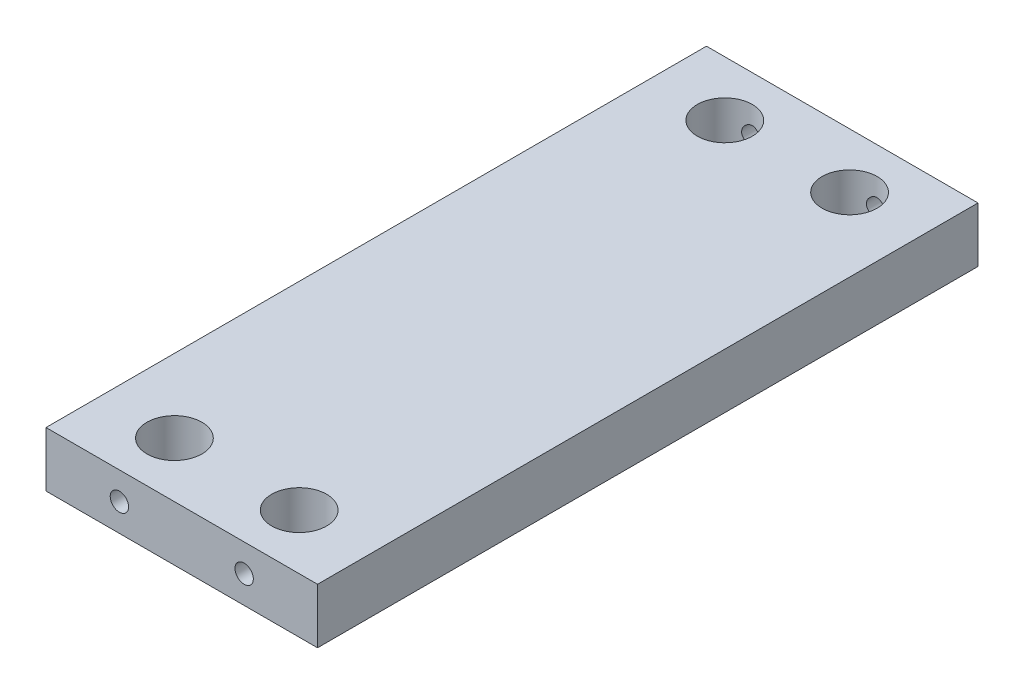
ISO-10303-21;
HEADER;
FILE_DESCRIPTION(('STEP AP214'),'2;1');
FILE_NAME('part.step','',(''),(''),'','','');
FILE_SCHEMA(('AUTOMOTIVE_DESIGN { 1 0 10303 214 1 1 1 1 }'));
ENDSEC;
DATA;
#1=APPLICATION_CONTEXT('core data for automotive mechanical design processes');
#2=APPLICATION_PROTOCOL_DEFINITION('international standard','automotive_design',2000,#1);
#3=PRODUCT_CONTEXT('',#1,'mechanical');
#4=PRODUCT('Part','Part','',(#3));
#5=PRODUCT_RELATED_PRODUCT_CATEGORY('part','',(#4));
#6=PRODUCT_DEFINITION_FORMATION('','',#4);
#7=PRODUCT_DEFINITION_CONTEXT('part definition',#1,'design');
#8=PRODUCT_DEFINITION('design','',#6,#7);
#9=PRODUCT_DEFINITION_SHAPE('','',#8);
#10=(LENGTH_UNIT() NAMED_UNIT(*) SI_UNIT(.MILLI.,.METRE.));
#11=(NAMED_UNIT(*) PLANE_ANGLE_UNIT() SI_UNIT($,.RADIAN.));
#12=(NAMED_UNIT(*) SI_UNIT($,.STERADIAN.) SOLID_ANGLE_UNIT());
#13=UNCERTAINTY_MEASURE_WITH_UNIT(LENGTH_MEASURE(1.E-05),#10,'distance_accuracy_value','');
#14=(GEOMETRIC_REPRESENTATION_CONTEXT(3) GLOBAL_UNCERTAINTY_ASSIGNED_CONTEXT((#13)) GLOBAL_UNIT_ASSIGNED_CONTEXT((#10,
#11,#12)) REPRESENTATION_CONTEXT('',''));
#15=CARTESIAN_POINT('',(0.,0.,0.));
#16=DIRECTION('',(0.,0.,1.));
#17=DIRECTION('',(1.,0.,0.));
#18=AXIS2_PLACEMENT_3D('',#15,#16,#17);
#19=CARTESIAN_POINT('',(46.99,19.05,-114.3));
#20=DIRECTION('',(-1.,0.,0.));
#21=DIRECTION('',(0.,0.,1.));
#22=AXIS2_PLACEMENT_3D('',#19,#20,#21);
#23=PLANE('',#22);
#24=DIRECTION('',(0.,0.,-1.));
#25=VECTOR('',#24,1.);
#26=CARTESIAN_POINT('',(46.99,0.,-114.3));
#27=LINE('',#26,#25);
#28=CARTESIAN_POINT('',(46.99,0.,114.3));
#29=VERTEX_POINT('',#28);
#30=CARTESIAN_POINT('',(46.99,0.,-114.3));
#31=VERTEX_POINT('',#30);
#32=EDGE_CURVE('E104',#29,#31,#27,.T.);
#33=ORIENTED_EDGE('',*,*,#32,.T.);
#34=DIRECTION('',(0.,-1.,0.));
#35=VECTOR('',#34,1.);
#36=CARTESIAN_POINT('',(46.99,19.05,-114.3));
#37=LINE('',#36,#35);
#38=CARTESIAN_POINT('',(46.99,19.05,-114.3));
#39=VERTEX_POINT('',#38);
#40=EDGE_CURVE('E11',#39,#31,#37,.T.);
#41=ORIENTED_EDGE('',*,*,#40,.F.);
#42=DIRECTION('',(0.,0.,-1.));
#43=VECTOR('',#42,1.);
#44=CARTESIAN_POINT('',(46.99,19.05,-114.3));
#45=LINE('',#44,#43);
#46=CARTESIAN_POINT('',(46.99,19.05,114.3));
#47=VERTEX_POINT('',#46);
#48=EDGE_CURVE('E91',#47,#39,#45,.T.);
#49=ORIENTED_EDGE('',*,*,#48,.F.);
#50=DIRECTION('',(0.,-1.,0.));
#51=VECTOR('',#50,1.);
#52=CARTESIAN_POINT('',(46.99,19.05,114.3));
#53=LINE('',#52,#51);
#54=EDGE_CURVE('E100',#47,#29,#53,.T.);
#55=ORIENTED_EDGE('',*,*,#54,.T.);
#56=EDGE_LOOP('',(#33,#41,#49,#55));
#57=FACE_BOUND('',#56,.T.);
#58=ADVANCED_FACE('F34',(#57),#23,.F.);
#59=CARTESIAN_POINT('',(-46.99,19.05,-114.3));
#60=DIRECTION('',(0.,0.,1.));
#61=DIRECTION('',(1.,0.,0.));
#62=AXIS2_PLACEMENT_3D('',#59,#60,#61);
#63=PLANE('',#62);
#64=CARTESIAN_POINT('',(-21.59,9.525,-114.3));
#65=DIRECTION('',(0.,0.,-1.));
#66=DIRECTION('',(-1.,0.,0.));
#67=AXIS2_PLACEMENT_3D('',#64,#65,#66);
#68=CIRCLE('',#67,3.175);
#69=CARTESIAN_POINT('',(-24.765,9.525,-114.3));
#70=VERTEX_POINT('',#69);
#71=EDGE_CURVE('E309',#70,#70,#68,.T.);
#72=ORIENTED_EDGE('',*,*,#71,.F.);
#73=EDGE_LOOP('',(#72));
#74=FACE_BOUND('',#73,.T.);
#75=CARTESIAN_POINT('',(21.59,9.525,-114.3));
#76=DIRECTION('',(0.,0.,-1.));
#77=DIRECTION('',(-1.,0.,0.));
#78=AXIS2_PLACEMENT_3D('',#75,#76,#77);
#79=CIRCLE('',#78,3.175);
#80=CARTESIAN_POINT('',(18.415,9.525,-114.3));
#81=VERTEX_POINT('',#80);
#82=EDGE_CURVE('E121',#81,#81,#79,.T.);
#83=ORIENTED_EDGE('',*,*,#82,.F.);
#84=EDGE_LOOP('',(#83));
#85=FACE_BOUND('',#84,.T.);
#86=DIRECTION('',(-1.,0.,0.));
#87=VECTOR('',#86,1.);
#88=CARTESIAN_POINT('',(-46.99,0.,-114.3));
#89=LINE('',#88,#87);
#90=CARTESIAN_POINT('',(-46.99,0.,-114.3));
#91=VERTEX_POINT('',#90);
#92=EDGE_CURVE('E95',#31,#91,#89,.T.);
#93=ORIENTED_EDGE('',*,*,#92,.T.);
#94=DIRECTION('',(0.,-1.,0.));
#95=VECTOR('',#94,1.);
#96=CARTESIAN_POINT('',(-46.99,19.05,-114.3));
#97=LINE('',#96,#95);
#98=CARTESIAN_POINT('',(-46.99,19.05,-114.3));
#99=VERTEX_POINT('',#98);
#100=EDGE_CURVE('E47',#99,#91,#97,.T.);
#101=ORIENTED_EDGE('',*,*,#100,.F.);
#102=DIRECTION('',(-1.,0.,0.));
#103=VECTOR('',#102,1.);
#104=CARTESIAN_POINT('',(-46.99,19.05,-114.3));
#105=LINE('',#104,#103);
#106=EDGE_CURVE('E86',#39,#99,#105,.T.);
#107=ORIENTED_EDGE('',*,*,#106,.F.);
#108=ORIENTED_EDGE('',*,*,#40,.T.);
#109=EDGE_LOOP('',(#93,#101,#107,#108));
#110=FACE_BOUND('',#109,.T.);
#111=ADVANCED_FACE('F94',(#74,#85,#110),#63,.F.);
#112=CARTESIAN_POINT('',(-46.99,19.05,-114.3));
#113=DIRECTION('',(1.,0.,0.));
#114=DIRECTION('',(0.,0.,-1.));
#115=AXIS2_PLACEMENT_3D('',#112,#113,#114);
#116=PLANE('',#115);
#117=DIRECTION('',(0.,0.,1.));
#118=VECTOR('',#117,1.);
#119=CARTESIAN_POINT('',(-46.99,0.,-114.3));
#120=LINE('',#119,#118);
#121=CARTESIAN_POINT('',(-46.99,0.,114.3));
#122=VERTEX_POINT('',#121);
#123=EDGE_CURVE('E73',#91,#122,#120,.T.);
#124=ORIENTED_EDGE('',*,*,#123,.T.);
#125=DIRECTION('',(0.,-1.,0.));
#126=VECTOR('',#125,1.);
#127=CARTESIAN_POINT('',(-46.99,19.05,114.3));
#128=LINE('',#127,#126);
#129=CARTESIAN_POINT('',(-46.99,19.05,114.3));
#130=VERTEX_POINT('',#129);
#131=EDGE_CURVE('E96',#130,#122,#128,.T.);
#132=ORIENTED_EDGE('',*,*,#131,.F.);
#133=DIRECTION('',(0.,0.,1.));
#134=VECTOR('',#133,1.);
#135=CARTESIAN_POINT('',(-46.99,19.05,-114.3));
#136=LINE('',#135,#134);
#137=EDGE_CURVE('E89',#99,#130,#136,.T.);
#138=ORIENTED_EDGE('',*,*,#137,.F.);
#139=ORIENTED_EDGE('',*,*,#100,.T.);
#140=EDGE_LOOP('',(#124,#132,#138,#139));
#141=FACE_BOUND('',#140,.T.);
#142=ADVANCED_FACE('F98',(#141),#116,.F.);
#143=CARTESIAN_POINT('',(-46.99,19.05,114.3));
#144=DIRECTION('',(0.,0.,-1.));
#145=DIRECTION('',(-1.,0.,0.));
#146=AXIS2_PLACEMENT_3D('',#143,#144,#145);
#147=PLANE('',#146);
#148=CARTESIAN_POINT('',(-21.59,9.525,114.3));
#149=DIRECTION('',(0.,0.,1.));
#150=DIRECTION('',(1.,0.,0.));
#151=AXIS2_PLACEMENT_3D('',#148,#149,#150);
#152=CIRCLE('',#151,3.175);
#153=CARTESIAN_POINT('',(-18.415,9.525,114.3));
#154=VERTEX_POINT('',#153);
#155=EDGE_CURVE('E264',#154,#154,#152,.T.);
#156=ORIENTED_EDGE('',*,*,#155,.F.);
#157=EDGE_LOOP('',(#156));
#158=FACE_BOUND('',#157,.T.);
#159=CARTESIAN_POINT('',(21.59,9.525,114.3));
#160=DIRECTION('',(0.,0.,1.));
#161=DIRECTION('',(1.,0.,0.));
#162=AXIS2_PLACEMENT_3D('',#159,#160,#161);
#163=CIRCLE('',#162,3.175);
#164=CARTESIAN_POINT('',(24.765,9.525,114.3));
#165=VERTEX_POINT('',#164);
#166=EDGE_CURVE('E263',#165,#165,#163,.T.);
#167=ORIENTED_EDGE('',*,*,#166,.F.);
#168=EDGE_LOOP('',(#167));
#169=FACE_BOUND('',#168,.T.);
#170=DIRECTION('',(1.,0.,0.));
#171=VECTOR('',#170,1.);
#172=CARTESIAN_POINT('',(-46.99,0.,114.3));
#173=LINE('',#172,#171);
#174=EDGE_CURVE('E79',#122,#29,#173,.T.);
#175=ORIENTED_EDGE('',*,*,#174,.T.);
#176=ORIENTED_EDGE('',*,*,#54,.F.);
#177=DIRECTION('',(1.,0.,0.));
#178=VECTOR('',#177,1.);
#179=CARTESIAN_POINT('',(-46.99,19.05,114.3));
#180=LINE('',#179,#178);
#181=EDGE_CURVE('E56',#130,#47,#180,.T.);
#182=ORIENTED_EDGE('',*,*,#181,.F.);
#183=ORIENTED_EDGE('',*,*,#131,.T.);
#184=EDGE_LOOP('',(#175,#176,#182,#183));
#185=FACE_BOUND('',#184,.T.);
#186=ADVANCED_FACE('F166',(#158,#169,#185),#147,.F.);
#187=CARTESIAN_POINT('',(46.99,19.05,114.3));
#188=DIRECTION('',(0.,1.,0.));
#189=DIRECTION('',(0.,0.,1.));
#190=AXIS2_PLACEMENT_3D('',#187,#188,#189);
#191=PLANE('',#190);
#192=CARTESIAN_POINT('',(21.59,19.05,95.25));
#193=DIRECTION('',(0.,1.,0.));
#194=DIRECTION('',(0.,0.,1.));
#195=AXIS2_PLACEMENT_3D('',#192,#193,#194);
#196=CIRCLE('',#195,9.525);
#197=CARTESIAN_POINT('',(21.59,19.05,104.775));
#198=VERTEX_POINT('',#197);
#199=EDGE_CURVE('E120',#198,#198,#196,.T.);
#200=ORIENTED_EDGE('',*,*,#199,.F.);
#201=EDGE_LOOP('',(#200));
#202=FACE_BOUND('',#201,.T.);
#203=CARTESIAN_POINT('',(21.59,19.05,-95.25));
#204=DIRECTION('',(0.,1.,0.));
#205=DIRECTION('',(0.,0.,1.));
#206=AXIS2_PLACEMENT_3D('',#203,#204,#205);
#207=CIRCLE('',#206,9.525);
#208=CARTESIAN_POINT('',(21.59,19.05,-85.7250000000001));
#209=VERTEX_POINT('',#208);
#210=EDGE_CURVE('E284',#209,#209,#207,.T.);
#211=ORIENTED_EDGE('',*,*,#210,.F.);
#212=EDGE_LOOP('',(#211));
#213=FACE_BOUND('',#212,.T.);
#214=CARTESIAN_POINT('',(-21.59,19.05,95.25));
#215=DIRECTION('',(0.,1.,0.));
#216=DIRECTION('',(0.,0.,1.));
#217=AXIS2_PLACEMENT_3D('',#214,#215,#216);
#218=CIRCLE('',#217,9.525);
#219=CARTESIAN_POINT('',(-21.59,19.05,104.775));
#220=VERTEX_POINT('',#219);
#221=EDGE_CURVE('E277',#220,#220,#218,.T.);
#222=ORIENTED_EDGE('',*,*,#221,.F.);
#223=EDGE_LOOP('',(#222));
#224=FACE_BOUND('',#223,.T.);
#225=CARTESIAN_POINT('',(-21.59,19.05,-95.25));
#226=DIRECTION('',(0.,1.,0.));
#227=DIRECTION('',(0.,0.,1.));
#228=AXIS2_PLACEMENT_3D('',#225,#226,#227);
#229=CIRCLE('',#228,9.525);
#230=CARTESIAN_POINT('',(-21.59,19.05,-85.7250000000001));
#231=VERTEX_POINT('',#230);
#232=EDGE_CURVE('E281',#231,#231,#229,.T.);
#233=ORIENTED_EDGE('',*,*,#232,.F.);
#234=EDGE_LOOP('',(#233));
#235=FACE_BOUND('',#234,.T.);
#236=ORIENTED_EDGE('',*,*,#48,.T.);
#237=ORIENTED_EDGE('',*,*,#106,.T.);
#238=ORIENTED_EDGE('',*,*,#137,.T.);
#239=ORIENTED_EDGE('',*,*,#181,.T.);
#240=EDGE_LOOP('',(#236,#237,#238,#239));
#241=FACE_BOUND('',#240,.T.);
#242=ADVANCED_FACE('F87',(#202,#213,#224,#235,#241),#191,.T.);
#243=CARTESIAN_POINT('',(46.99,0.,114.3));
#244=DIRECTION('',(0.,1.,0.));
#245=DIRECTION('',(0.,0.,1.));
#246=AXIS2_PLACEMENT_3D('',#243,#244,#245);
#247=PLANE('',#246);
#248=CARTESIAN_POINT('',(21.59,0.,95.25));
#249=DIRECTION('',(0.,1.,0.));
#250=DIRECTION('',(0.,0.,1.));
#251=AXIS2_PLACEMENT_3D('',#248,#249,#250);
#252=CIRCLE('',#251,9.525);
#253=CARTESIAN_POINT('',(21.59,0.,104.775));
#254=VERTEX_POINT('',#253);
#255=EDGE_CURVE('E299',#254,#254,#252,.T.);
#256=ORIENTED_EDGE('',*,*,#255,.T.);
#257=EDGE_LOOP('',(#256));
#258=FACE_BOUND('',#257,.T.);
#259=CARTESIAN_POINT('',(21.59,0.,-95.25));
#260=DIRECTION('',(0.,1.,0.));
#261=DIRECTION('',(0.,0.,1.));
#262=AXIS2_PLACEMENT_3D('',#259,#260,#261);
#263=CIRCLE('',#262,9.525);
#264=CARTESIAN_POINT('',(21.59,0.,-85.7250000000001));
#265=VERTEX_POINT('',#264);
#266=EDGE_CURVE('E279',#265,#265,#263,.T.);
#267=ORIENTED_EDGE('',*,*,#266,.T.);
#268=EDGE_LOOP('',(#267));
#269=FACE_BOUND('',#268,.T.);
#270=CARTESIAN_POINT('',(-21.59,0.,95.25));
#271=DIRECTION('',(0.,1.,0.));
#272=DIRECTION('',(0.,0.,1.));
#273=AXIS2_PLACEMENT_3D('',#270,#271,#272);
#274=CIRCLE('',#273,9.525);
#275=CARTESIAN_POINT('',(-21.59,0.,104.775));
#276=VERTEX_POINT('',#275);
#277=EDGE_CURVE('E274',#276,#276,#274,.T.);
#278=ORIENTED_EDGE('',*,*,#277,.T.);
#279=EDGE_LOOP('',(#278));
#280=FACE_BOUND('',#279,.T.);
#281=CARTESIAN_POINT('',(-21.59,0.,-95.25));
#282=DIRECTION('',(0.,1.,0.));
#283=DIRECTION('',(0.,0.,1.));
#284=AXIS2_PLACEMENT_3D('',#281,#282,#283);
#285=CIRCLE('',#284,9.525);
#286=CARTESIAN_POINT('',(-21.59,0.,-85.7250000000001));
#287=VERTEX_POINT('',#286);
#288=EDGE_CURVE('E107',#287,#287,#285,.T.);
#289=ORIENTED_EDGE('',*,*,#288,.T.);
#290=EDGE_LOOP('',(#289));
#291=FACE_BOUND('',#290,.T.);
#292=ORIENTED_EDGE('',*,*,#32,.F.);
#293=ORIENTED_EDGE('',*,*,#174,.F.);
#294=ORIENTED_EDGE('',*,*,#123,.F.);
#295=ORIENTED_EDGE('',*,*,#92,.F.);
#296=EDGE_LOOP('',(#292,#293,#294,#295));
#297=FACE_BOUND('',#296,.T.);
#298=ADVANCED_FACE('F156',(#258,#269,#280,#291,#297),#247,.F.);
#299=CARTESIAN_POINT('',(-21.59,19.05,-95.25));
#300=DIRECTION('',(0.,1.,0.));
#301=DIRECTION('',(0.,0.,1.));
#302=AXIS2_PLACEMENT_3D('',#299,#300,#301);
#303=CYLINDRICAL_SURFACE('',#302,9.525);
#304=CARTESIAN_POINT('',(-24.765,9.525,-104.230256121069));
#305=CARTESIAN_POINT('',(-24.765000818984,9.69793645510453,-104.230255551341));
#306=CARTESIAN_POINT('',(-24.7508229382015,9.87086798943991,-104.235306174985));
#307=CARTESIAN_POINT('',(-24.694677343112,10.2116077866567,-104.25485797708));
#308=CARTESIAN_POINT('',(-24.6527050511347,10.3794152008451,-104.269360712265));
#309=CARTESIAN_POINT('',(-24.5426086670496,10.7049153852664,-104.305995467119));
#310=CARTESIAN_POINT('',(-24.4745358279553,10.8626272759806,-104.32811252609));
#311=CARTESIAN_POINT('',(-24.3143456703014,11.1644431541398,-104.377462123828));
#312=CARTESIAN_POINT('',(-24.2222230466311,11.3085441296078,-104.40469579089));
#313=CARTESIAN_POINT('',(-24.0126873899561,11.5846858804241,-104.462405038687));
#314=CARTESIAN_POINT('',(-23.8944922838749,11.7161164860327,-104.492961411317));
#315=CARTESIAN_POINT('',(-23.6378358434057,11.9577065938882,-104.553190207432));
#316=CARTESIAN_POINT('',(-23.4993712607913,12.067862680274,-104.58286248832));
#317=CARTESIAN_POINT('',(-23.2016443127889,12.2665454990215,-104.638915274767));
#318=CARTESIAN_POINT('',(-23.0419335681379,12.354432906712,-104.665189694526));
#319=CARTESIAN_POINT('',(-22.7089691329852,12.5018532827798,-104.710534379979));
#320=CARTESIAN_POINT('',(-22.5357191070569,12.5613938928367,-104.729606586945));
#321=CARTESIAN_POINT('',(-22.1869914953514,12.6483613384578,-104.757825644963));
#322=CARTESIAN_POINT('',(-22.0118011466582,12.676833441866,-104.767294744188));
#323=CARTESIAN_POINT('',(-21.6588907525665,12.7041792314201,-104.776384560929));
#324=CARTESIAN_POINT('',(-21.4811713709981,12.7030605464964,-104.776007816847));
#325=CARTESIAN_POINT('',(-21.1356463392597,12.6719194917529,-104.765666757895));
#326=CARTESIAN_POINT('',(-20.9677252457215,12.6430324720935,-104.756079055975));
#327=CARTESIAN_POINT('',(-20.6392670817396,12.559052285387,-104.728866213037));
#328=CARTESIAN_POINT('',(-20.478730512551,12.5039573422391,-104.71124052729));
#329=CARTESIAN_POINT('',(-20.1671158923767,12.3684623175533,-104.66945253181));
#330=CARTESIAN_POINT('',(-20.0161898984239,12.2877391451148,-104.645207350138));
#331=CARTESIAN_POINT('',(-19.7296902664508,12.1035454352005,-104.592703978986));
#332=CARTESIAN_POINT('',(-19.5941209133266,12.0000685724348,-104.564444674397));
#333=CARTESIAN_POINT('',(-19.3354297486996,11.7675838007655,-104.505321591234));
#334=CARTESIAN_POINT('',(-19.2131945013178,11.6376032238533,-104.474397831612));
#335=CARTESIAN_POINT('',(-18.9919697007758,11.358725295818,-104.414552894153));
#336=CARTESIAN_POINT('',(-18.8929837300811,11.2098250348135,-104.385632025423));
#337=CARTESIAN_POINT('',(-18.7198398302615,10.8945247387091,-104.332739172595));
#338=CARTESIAN_POINT('',(-18.6460559780023,10.7279054830661,-104.308843619791));
#339=CARTESIAN_POINT('',(-18.5278928613699,10.3836108233692,-104.269592413674));
#340=CARTESIAN_POINT('',(-18.4835012735017,10.2059400871702,-104.254233181715));
#341=CARTESIAN_POINT('',(-18.4271879293404,9.85317322156825,-104.23460345302));
#342=CARTESIAN_POINT('',(-18.4138916217633,9.67832257642302,-104.229863940121));
#343=CARTESIAN_POINT('',(-18.4162527314617,9.32886072656271,-104.230699337879));
#344=CARTESIAN_POINT('',(-18.431904889905,9.15424948412383,-104.23627237514));
#345=CARTESIAN_POINT('',(-18.4904835563214,8.81647663386469,-104.256637374367));
#346=CARTESIAN_POINT('',(-18.5324546991113,8.65312775927108,-104.271106082747));
#347=CARTESIAN_POINT('',(-18.6413334863705,8.33582405019059,-104.307276579055));
#348=CARTESIAN_POINT('',(-18.7082455515462,8.18187088669927,-104.328979649181));
#349=CARTESIAN_POINT('',(-18.8675189681539,7.88231716381078,-104.378025863666));
#350=CARTESIAN_POINT('',(-18.9606201992118,7.73713640961228,-104.405526064884));
#351=CARTESIAN_POINT('',(-19.1687906229798,7.46396128368169,-104.462763157208));
#352=CARTESIAN_POINT('',(-19.2838662915414,7.33597199725063,-104.492500706091));
#353=CARTESIAN_POINT('',(-19.5392938337665,7.09444865051222,-104.552592476752));
#354=CARTESIAN_POINT('',(-19.6805954160144,6.98190631169015,-104.582907533598));
#355=CARTESIAN_POINT('',(-19.9808233498042,6.78206624804496,-104.639327538716));
#356=CARTESIAN_POINT('',(-20.1397490750551,6.6947676265593,-104.665432636512));
#357=CARTESIAN_POINT('',(-20.4699239367775,6.54869116706406,-104.710369884487));
#358=CARTESIAN_POINT('',(-20.6410841834552,6.48972769505489,-104.729249202644));
#359=CARTESIAN_POINT('',(-20.9916443709389,6.40166441895917,-104.757810894099));
#360=CARTESIAN_POINT('',(-21.1710413130464,6.37255383512941,-104.76749658708));
#361=CARTESIAN_POINT('',(-21.5239113086444,6.34599290360209,-104.776329157751));
#362=CARTESIAN_POINT('',(-21.6972664984461,6.34711883376471,-104.77594996284));
#363=CARTESIAN_POINT('',(-22.0412028853756,6.37748695336485,-104.765862239491));
#364=CARTESIAN_POINT('',(-22.2117843064005,6.40672686188505,-104.756154467891));
#365=CARTESIAN_POINT('',(-22.5426337291968,6.49154859477868,-104.728674049803));
#366=CARTESIAN_POINT('',(-22.7030225101481,6.54670463374556,-104.711031952967));
#367=CARTESIAN_POINT('',(-23.0123312642339,6.68139866123347,-104.669499852368));
#368=CARTESIAN_POINT('',(-23.1612491566522,6.76094106025052,-104.645608718525));
#369=CARTESIAN_POINT('',(-23.4493880017804,6.94553320092388,-104.592941335285));
#370=CARTESIAN_POINT('',(-23.5880473486954,7.05141682608671,-104.564017201619));
#371=CARTESIAN_POINT('',(-23.846094758415,7.28426721692092,-104.504902394142));
#372=CARTESIAN_POINT('',(-23.9654766486581,7.41124070918416,-104.474711318546));
#373=CARTESIAN_POINT('',(-24.1863302430452,7.68860970398856,-104.415059134463));
#374=CARTESIAN_POINT('',(-24.2869179170433,7.83972749735083,-104.385672863639));
#375=CARTESIAN_POINT('',(-24.461198039981,8.15763680541633,-104.332411138006));
#376=CARTESIAN_POINT('',(-24.5348975164018,8.32442421036919,-104.30853424387));
#377=CARTESIAN_POINT('',(-24.6502041545482,8.66127879124963,-104.270217361057));
#378=CARTESIAN_POINT('',(-24.6931113615497,8.83085693669304,-104.255399593216));
#379=CARTESIAN_POINT('',(-24.7505039664739,9.17529296023178,-104.23542092738));
#380=CARTESIAN_POINT('',(-24.7649991719492,9.350148995279,-104.230256697104));
#381=CARTESIAN_POINT('',(-24.765,9.525,-104.230256121069));
#382=B_SPLINE_CURVE_WITH_KNOTS('',3,(#304,#305,#306,#307,#308,#309,#310,#311,#312,#313,#314,
#315,#316,#317,#318,#319,#320,#321,#322,#323,#324,#325,#326,#327,#328,#329,#330,#331,#332,#333,
#334,#335,#336,#337,#338,#339,#340,#341,#342,#343,#344,#345,#346,#347,#348,#349,#350,#351,#352,
#353,#354,#355,#356,#357,#358,#359,#360,#361,#362,#363,#364,#365,#366,#367,#368,#369,#370,#371,
#372,#373,#374,#375,#376,#377,#378,#379,#380,#381),.UNSPECIFIED.,.T.,.F.,(4,2,2,2,2,2,2,2,2,2,2,
2,2,2,2,2,2,2,2,2,2,2,2,2,2,2,2,2,2,2,2,2,2,2,2,2,2,2,4),(0.,0.518161856737954,1.03640907467314,
1.55364379231513,2.07099270263878,2.60671746332528,3.14252816921061,3.69231882006111,
4.24196117528055,4.77247962078666,5.30286129234888,5.81244090321181,6.32205505300826,
6.83836754181563,7.35482374200019,7.89559553605438,8.43645060268435,8.985016315017,
9.53335188057254,10.0569487508209,10.5804505128322,11.0859695656586,11.5915782629155,
12.1132237331089,12.6350231697725,13.1819271594322,13.7288117205516,14.2720628703095,
14.815117785382,15.3326491885149,15.8501386073105,16.3594083542836,16.8687702617329,
17.3969527447801,17.925304015736,18.4743376618726,19.023227709973,19.5473069861654,
20.0712053232972),.UNSPECIFIED.);
#383=CARTESIAN_POINT('',(-24.765,9.525,-104.230256121069));
#384=VERTEX_POINT('',#383);
#385=EDGE_CURVE('E37',#384,#384,#382,.T.);
#386=ORIENTED_EDGE('',*,*,#385,.T.);
#387=EDGE_LOOP('',(#386));
#388=FACE_BOUND('',#387,.T.);
#389=ORIENTED_EDGE('',*,*,#288,.F.);
#390=EDGE_LOOP('',(#389));
#391=FACE_BOUND('',#390,.T.);
#392=ORIENTED_EDGE('',*,*,#232,.T.);
#393=EDGE_LOOP('',(#392));
#394=FACE_BOUND('',#393,.T.);
#395=ADVANCED_FACE('F158',(#388,#391,#394),#303,.F.);
#396=CARTESIAN_POINT('',(-21.59,19.05,95.25));
#397=DIRECTION('',(0.,1.,0.));
#398=DIRECTION('',(0.,0.,1.));
#399=AXIS2_PLACEMENT_3D('',#396,#397,#398);
#400=CYLINDRICAL_SURFACE('',#399,9.525);
#401=CARTESIAN_POINT('',(-21.59,6.35,104.775));
#402=CARTESIAN_POINT('',(-21.4167613228347,6.34999919440204,104.775000485805));
#403=CARTESIAN_POINT('',(-21.2435275073401,6.36422484495392,104.770230181865));
#404=CARTESIAN_POINT('',(-20.9021624092283,6.42057742049467,104.751670423954));
#405=CARTESIAN_POINT('',(-20.7340316582228,6.46270724203783,104.737880033668));
#406=CARTESIAN_POINT('',(-20.4078433933319,6.57326359774436,104.70277852603));
#407=CARTESIAN_POINT('',(-20.2497695528119,6.64164617330819,104.681479985455));
#408=CARTESIAN_POINT('',(-19.9473345756431,6.80256822376175,104.633536151526));
#409=CARTESIAN_POINT('',(-19.8029761516561,6.89511246388326,104.606889803702));
#410=CARTESIAN_POINT('',(-19.5270701818043,7.10509693042654,104.550022498565));
#411=CARTESIAN_POINT('',(-19.3960632515529,7.22322416877707,104.519715917725));
#412=CARTESIAN_POINT('',(-19.1553062006709,7.47956071619335,104.459414994364));
#413=CARTESIAN_POINT('',(-19.045560761071,7.61777443589803,104.429420721975));
#414=CARTESIAN_POINT('',(-18.8473558084266,7.91522774074876,104.372198306153));
#415=CARTESIAN_POINT('',(-18.7595990751482,8.07495762364949,104.345074497003));
#416=CARTESIAN_POINT('',(-18.6124250754382,8.40795909990588,104.297965947041));
#417=CARTESIAN_POINT('',(-18.552999160797,8.58122654199171,104.277979028104));
#418=CARTESIAN_POINT('',(-18.4662017597084,8.93023747825206,104.248308878803));
#419=CARTESIAN_POINT('',(-18.4378173017371,9.10570063695278,104.238301040685));
#420=CARTESIAN_POINT('',(-18.410741933413,9.45916241944492,104.228762097987));
#421=CARTESIAN_POINT('',(-18.412041847405,9.63716024275168,104.229227755972));
#422=CARTESIAN_POINT('',(-18.4435118057417,9.98199880165977,104.24029872651));
#423=CARTESIAN_POINT('',(-18.4723598256948,10.1489776792679,104.250439703794));
#424=CARTESIAN_POINT('',(-18.5559504329531,10.4755741072517,104.278958882755));
#425=CARTESIAN_POINT('',(-18.6106961205708,10.6351907737563,104.297338070645));
#426=CARTESIAN_POINT('',(-18.7453934906588,10.9455354799529,104.340593678417));
#427=CARTESIAN_POINT('',(-18.8257368953545,11.0960789808657,104.365569963932));
#428=CARTESIAN_POINT('',(-19.0090770874875,11.3819651337881,104.419163734779));
#429=CARTESIAN_POINT('',(-19.1120804182443,11.5173033780135,104.447782270847));
#430=CARTESIAN_POINT('',(-19.3441658687339,11.7763658241605,104.507262701076));
#431=CARTESIAN_POINT('',(-19.4743287485077,11.8991148050663,104.538163712016));
#432=CARTESIAN_POINT('',(-19.7537718653451,12.1212967716563,104.597420293788));
#433=CARTESIAN_POINT('',(-19.9030539337769,12.2207275211723,104.625775620334));
#434=CARTESIAN_POINT('',(-20.2185663285781,12.3942357532463,104.677118177025));
#435=CARTESIAN_POINT('',(-20.3849500973781,12.4680519350068,104.700049362755));
#436=CARTESIAN_POINT('',(-20.7287206603177,12.5863450773094,104.737553006836));
#437=CARTESIAN_POINT('',(-20.906103608858,12.6308322294694,104.752128368542));
#438=CARTESIAN_POINT('',(-21.2585813412445,12.687476739621,104.770797159518));
#439=CARTESIAN_POINT('',(-21.4334420204291,12.7009518941235,104.775317558221));
#440=CARTESIAN_POINT('',(-21.7829608471238,12.6989437613249,104.774647660561));
#441=CARTESIAN_POINT('',(-21.9576190238399,12.6834653620639,104.769459003315));
#442=CARTESIAN_POINT('',(-22.296500575516,12.6250321929383,104.750235784768));
#443=CARTESIAN_POINT('',(-22.4608796617006,12.5828862957929,104.73646180908));
#444=CARTESIAN_POINT('',(-22.7801676684902,12.4733258138181,104.701716136855));
#445=CARTESIAN_POINT('',(-22.9350753785148,12.4059080066898,104.680743522482));
#446=CARTESIAN_POINT('',(-23.2355653410487,12.2457513789055,104.633043568371));
#447=CARTESIAN_POINT('',(-23.3807951205144,12.1523931663259,104.606179368496));
#448=CARTESIAN_POINT('',(-23.6539558356805,11.9437335737072,104.549741811841));
#449=CARTESIAN_POINT('',(-23.781881467751,11.8284254920991,104.520167629104));
#450=CARTESIAN_POINT('',(-24.022851712285,11.5729424655541,104.459939923379));
#451=CARTESIAN_POINT('',(-24.1349560773553,11.4318757045072,104.429298414526));
#452=CARTESIAN_POINT('',(-24.3340176333774,11.1322752722004,104.371774152107));
#453=CARTESIAN_POINT('',(-24.420974614681,10.9737414553368,104.344891429879));
#454=CARTESIAN_POINT('',(-24.566870254072,10.6436381764546,104.298190939376));
#455=CARTESIAN_POINT('',(-24.6258655696239,10.4720958986392,104.278358905177));
#456=CARTESIAN_POINT('',(-24.713865566961,10.1206977861099,104.24829392573));
#457=CARTESIAN_POINT('',(-24.7428837594788,9.94084573484119,104.238056656301));
#458=CARTESIAN_POINT('',(-24.7690521968656,9.58787422007009,104.228832019255));
#459=CARTESIAN_POINT('',(-24.7677630669542,9.41488356958934,104.229293708173));
#460=CARTESIAN_POINT('',(-24.7371942816996,9.07172088712245,104.240052816908));
#461=CARTESIAN_POINT('',(-24.707916292281,8.9015486879926,104.250349651327));
#462=CARTESIAN_POINT('',(-24.6233055066857,8.57206926996715,104.27920864668));
#463=CARTESIAN_POINT('',(-24.5684781235993,8.41261708061073,104.297610112214));
#464=CARTESIAN_POINT('',(-24.4347344862872,8.105052982971,104.340545662486));
#465=CARTESIAN_POINT('',(-24.3558128851583,7.95694360097808,104.365081108238));
#466=CARTESIAN_POINT('',(-24.1721026989524,7.66926434799476,104.418854827927));
#467=CARTESIAN_POINT('',(-24.0663356707776,7.53034910647263,104.448251594638));
#468=CARTESIAN_POINT('',(-23.8335911539557,7.27173484250517,104.507771561993));
#469=CARTESIAN_POINT('',(-23.7066076681335,7.15204127219036,104.537894965968));
#470=CARTESIAN_POINT('',(-23.4290919432232,6.93056649098186,104.596883469186));
#471=CARTESIAN_POINT('',(-23.2778348053616,6.82966519589058,104.62565377219));
#472=CARTESIAN_POINT('',(-22.959559609766,6.6548303883992,104.67740021973));
#473=CARTESIAN_POINT('',(-22.7925455950702,6.58088998169752,104.700377845077));
#474=CARTESIAN_POINT('',(-22.4551673298631,6.46518381684847,104.737075103426));
#475=CARTESIAN_POINT('',(-22.2852861306226,6.42212816961378,104.751162494415));
#476=CARTESIAN_POINT('',(-21.9402673208325,6.36454060885013,104.770123424289));
#477=CARTESIAN_POINT('',(-21.7651311761808,6.3500008143985,104.774999508888));
#478=CARTESIAN_POINT('',(-21.59,6.35,104.775));
#479=B_SPLINE_CURVE_WITH_KNOTS('',3,(#401,#402,#403,#404,#405,#406,#407,#408,#409,#410,#411,
#412,#413,#414,#415,#416,#417,#418,#419,#420,#421,#422,#423,#424,#425,#426,#427,#428,#429,#430,
#431,#432,#433,#434,#435,#436,#437,#438,#439,#440,#441,#442,#443,#444,#445,#446,#447,#448,#449,
#450,#451,#452,#453,#454,#455,#456,#457,#458,#459,#460,#461,#462,#463,#464,#465,#466,#467,#468,
#469,#470,#471,#472,#473,#474,#475,#476,#477,#478),.UNSPECIFIED.,.T.,.F.,(4,2,2,2,2,2,2,2,2,2,2,
2,2,2,2,2,2,2,2,2,2,2,2,2,2,2,2,2,2,2,2,2,2,2,2,2,2,2,4),(0.,0.519071561632581,1.03819701322437,
1.55645698636312,2.07481924951214,2.6093637259775,3.14402575687908,3.69406121814518,
4.24392866899745,4.77526114230342,5.30642937910266,5.81332424300314,6.32027980466155,
6.83539943417539,7.35066800622307,7.89283745951089,8.43505888444012,8.98265937939884,
9.53006948685135,10.0537512658116,10.5773446429626,11.0857715158083,11.5942632377703,
12.1161301950386,12.638156741095,13.1839024764639,13.7296527614611,14.2742924389999,
14.8186865394104,15.3351123975402,15.8515075194061,16.3580948898032,16.8647947620873,
17.3936046174648,17.92256420318,18.4721392315144,19.0215736265905,19.5464607283686,
20.0712027467109),.UNSPECIFIED.);
#480=CARTESIAN_POINT('',(-21.59,6.35,104.775));
#481=VERTEX_POINT('',#480);
#482=EDGE_CURVE('E259',#481,#481,#479,.T.);
#483=ORIENTED_EDGE('',*,*,#482,.T.);
#484=EDGE_LOOP('',(#483));
#485=FACE_BOUND('',#484,.T.);
#486=ORIENTED_EDGE('',*,*,#277,.F.);
#487=EDGE_LOOP('',(#486));
#488=FACE_BOUND('',#487,.T.);
#489=ORIENTED_EDGE('',*,*,#221,.T.);
#490=EDGE_LOOP('',(#489));
#491=FACE_BOUND('',#490,.T.);
#492=ADVANCED_FACE('F144',(#485,#488,#491),#400,.F.);
#493=CARTESIAN_POINT('',(21.59,19.05,-95.25));
#494=DIRECTION('',(0.,1.,0.));
#495=DIRECTION('',(0.,0.,1.));
#496=AXIS2_PLACEMENT_3D('',#493,#494,#495);
#497=CYLINDRICAL_SURFACE('',#496,9.525);
#498=CARTESIAN_POINT('',(18.415,9.525,-104.230256121069));
#499=CARTESIAN_POINT('',(18.414999181016,9.69793645510453,-104.230255551341));
#500=CARTESIAN_POINT('',(18.4291770617985,9.87086798943991,-104.235306174985));
#501=CARTESIAN_POINT('',(18.485322656888,10.2116077866567,-104.25485797708));
#502=CARTESIAN_POINT('',(18.5272949488654,10.3794152008451,-104.269360712265));
#503=CARTESIAN_POINT('',(18.6373913329504,10.7049153852664,-104.305995467119));
#504=CARTESIAN_POINT('',(18.7054641720447,10.8626272759806,-104.32811252609));
#505=CARTESIAN_POINT('',(18.8656543296986,11.1644431541398,-104.377462123828));
#506=CARTESIAN_POINT('',(18.9577769533689,11.3085441296078,-104.40469579089));
#507=CARTESIAN_POINT('',(19.1673126100439,11.5846858804241,-104.462405038687));
#508=CARTESIAN_POINT('',(19.2855077161251,11.7161164860327,-104.492961411317));
#509=CARTESIAN_POINT('',(19.5421641565943,11.9577065938882,-104.553190207432));
#510=CARTESIAN_POINT('',(19.6806287392087,12.067862680274,-104.58286248832));
#511=CARTESIAN_POINT('',(19.9783556872111,12.2665454990215,-104.638915274767));
#512=CARTESIAN_POINT('',(20.1380664318621,12.354432906712,-104.665189694526));
#513=CARTESIAN_POINT('',(20.4710308670148,12.5018532827798,-104.710534379979));
#514=CARTESIAN_POINT('',(20.6442808929431,12.5613938928367,-104.729606586945));
#515=CARTESIAN_POINT('',(20.9930085046487,12.6483613384578,-104.757825644963));
#516=CARTESIAN_POINT('',(21.1681988533418,12.676833441866,-104.767294744188));
#517=CARTESIAN_POINT('',(21.5211092474335,12.7041792314201,-104.776384560929));
#518=CARTESIAN_POINT('',(21.6988286290019,12.7030605464964,-104.776007816847));
#519=CARTESIAN_POINT('',(22.0443536607404,12.6719194917529,-104.765666757895));
#520=CARTESIAN_POINT('',(22.2122747542785,12.6430324720935,-104.756079055975));
#521=CARTESIAN_POINT('',(22.5407329182604,12.559052285387,-104.728866213037));
#522=CARTESIAN_POINT('',(22.701269487449,12.5039573422391,-104.71124052729));
#523=CARTESIAN_POINT('',(23.0128841076233,12.3684623175533,-104.66945253181));
#524=CARTESIAN_POINT('',(23.1638101015761,12.2877391451148,-104.645207350138));
#525=CARTESIAN_POINT('',(23.4503097335493,12.1035454352005,-104.592703978986));
#526=CARTESIAN_POINT('',(23.5858790866735,12.0000685724348,-104.564444674397));
#527=CARTESIAN_POINT('',(23.8445702513004,11.7675838007655,-104.505321591234));
#528=CARTESIAN_POINT('',(23.9668054986822,11.6376032238533,-104.474397831612));
#529=CARTESIAN_POINT('',(24.1880302992242,11.358725295818,-104.414552894153));
#530=CARTESIAN_POINT('',(24.2870162699189,11.2098250348135,-104.385632025423));
#531=CARTESIAN_POINT('',(24.4601601697385,10.8945247387091,-104.332739172595));
#532=CARTESIAN_POINT('',(24.5339440219978,10.7279054830661,-104.308843619791));
#533=CARTESIAN_POINT('',(24.6521071386302,10.3836108233692,-104.269592413674));
#534=CARTESIAN_POINT('',(24.6964987264983,10.2059400871702,-104.254233181715));
#535=CARTESIAN_POINT('',(24.7528120706596,9.85317322156825,-104.23460345302));
#536=CARTESIAN_POINT('',(24.7661083782367,9.67832257642302,-104.229863940121));
#537=CARTESIAN_POINT('',(24.7637472685384,9.32886072656271,-104.230699337879));
#538=CARTESIAN_POINT('',(24.748095110095,9.15424948412384,-104.23627237514));
#539=CARTESIAN_POINT('',(24.6895164436786,8.81647663386469,-104.256637374367));
#540=CARTESIAN_POINT('',(24.6475453008887,8.65312775927108,-104.271106082747));
#541=CARTESIAN_POINT('',(24.5386665136295,8.33582405019059,-104.307276579055));
#542=CARTESIAN_POINT('',(24.4717544484539,8.18187088669927,-104.328979649181));
#543=CARTESIAN_POINT('',(24.3124810318461,7.88231716381078,-104.378025863666));
#544=CARTESIAN_POINT('',(24.2193798007882,7.73713640961228,-104.405526064884));
#545=CARTESIAN_POINT('',(24.0112093770203,7.46396128368169,-104.462763157208));
#546=CARTESIAN_POINT('',(23.8961337084586,7.33597199725063,-104.492500706091));
#547=CARTESIAN_POINT('',(23.6407061662335,7.09444865051222,-104.552592476752));
#548=CARTESIAN_POINT('',(23.4994045839856,6.98190631169015,-104.582907533598));
#549=CARTESIAN_POINT('',(23.1991766501958,6.78206624804496,-104.639327538716));
#550=CARTESIAN_POINT('',(23.040250924945,6.6947676265593,-104.665432636512));
#551=CARTESIAN_POINT('',(22.7100760632225,6.54869116706406,-104.710369884487));
#552=CARTESIAN_POINT('',(22.5389158165448,6.48972769505489,-104.729249202644));
#553=CARTESIAN_POINT('',(22.1883556290611,6.40166441895917,-104.757810894099));
#554=CARTESIAN_POINT('',(22.0089586869536,6.37255383512941,-104.76749658708));
#555=CARTESIAN_POINT('',(21.6560886913556,6.34599290360209,-104.776329157751));
#556=CARTESIAN_POINT('',(21.482733501554,6.34711883376471,-104.77594996284));
#557=CARTESIAN_POINT('',(21.1387971146245,6.37748695336485,-104.765862239491));
#558=CARTESIAN_POINT('',(20.9682156935995,6.40672686188505,-104.756154467891));
#559=CARTESIAN_POINT('',(20.6373662708032,6.49154859477868,-104.728674049803));
#560=CARTESIAN_POINT('',(20.4769774898519,6.54670463374556,-104.711031952967));
#561=CARTESIAN_POINT('',(20.1676687357662,6.68139866123347,-104.669499852368));
#562=CARTESIAN_POINT('',(20.0187508433478,6.76094106025052,-104.645608718525));
#563=CARTESIAN_POINT('',(19.7306119982196,6.94553320092388,-104.592941335285));
#564=CARTESIAN_POINT('',(19.5919526513046,7.05141682608671,-104.564017201619));
#565=CARTESIAN_POINT('',(19.3339052415851,7.28426721692092,-104.504902394142));
#566=CARTESIAN_POINT('',(19.2145233513419,7.41124070918416,-104.474711318546));
#567=CARTESIAN_POINT('',(18.9936697569549,7.68860970398856,-104.415059134463));
#568=CARTESIAN_POINT('',(18.8930820829567,7.83972749735083,-104.385672863639));
#569=CARTESIAN_POINT('',(18.718801960019,8.15763680541633,-104.332411138006));
#570=CARTESIAN_POINT('',(18.6451024835982,8.32442421036919,-104.30853424387));
#571=CARTESIAN_POINT('',(18.5297958454518,8.66127879124963,-104.270217361057));
#572=CARTESIAN_POINT('',(18.4868886384503,8.83085693669304,-104.255399593216));
#573=CARTESIAN_POINT('',(18.4294960335261,9.17529296023178,-104.23542092738));
#574=CARTESIAN_POINT('',(18.4150008280508,9.350148995279,-104.230256697104));
#575=CARTESIAN_POINT('',(18.415,9.525,-104.230256121069));
#576=B_SPLINE_CURVE_WITH_KNOTS('',3,(#498,#499,#500,#501,#502,#503,#504,#505,#506,#507,#508,
#509,#510,#511,#512,#513,#514,#515,#516,#517,#518,#519,#520,#521,#522,#523,#524,#525,#526,#527,
#528,#529,#530,#531,#532,#533,#534,#535,#536,#537,#538,#539,#540,#541,#542,#543,#544,#545,#546,
#547,#548,#549,#550,#551,#552,#553,#554,#555,#556,#557,#558,#559,#560,#561,#562,#563,#564,#565,
#566,#567,#568,#569,#570,#571,#572,#573,#574,#575),.UNSPECIFIED.,.T.,.F.,(4,2,2,2,2,2,2,2,2,2,2,
2,2,2,2,2,2,2,2,2,2,2,2,2,2,2,2,2,2,2,2,2,2,2,2,2,2,2,4),(0.,0.518161856737954,1.03640907467314,
1.55364379231513,2.07099270263878,2.60671746332528,3.14252816921061,3.69231882006111,
4.24196117528055,4.77247962078666,5.30286129234888,5.81244090321181,6.32205505300826,
6.83836754181563,7.35482374200019,7.89559553605438,8.43645060268435,8.985016315017,
9.53335188057254,10.0569487508209,10.5804505128322,11.0859695656586,11.5915782629155,
12.1132237331089,12.6350231697725,13.1819271594322,13.7288117205516,14.2720628703095,
14.815117785382,15.3326491885149,15.8501386073105,16.3594083542836,16.8687702617329,
17.3969527447801,17.925304015736,18.4743376618726,19.023227709973,19.5473069861654,
20.0712053232972),.UNSPECIFIED.);
#577=CARTESIAN_POINT('',(18.415,9.525,-104.230256121069));
#578=VERTEX_POINT('',#577);
#579=EDGE_CURVE('E113',#578,#578,#576,.T.);
#580=ORIENTED_EDGE('',*,*,#579,.T.);
#581=EDGE_LOOP('',(#580));
#582=FACE_BOUND('',#581,.T.);
#583=ORIENTED_EDGE('',*,*,#266,.F.);
#584=EDGE_LOOP('',(#583));
#585=FACE_BOUND('',#584,.T.);
#586=ORIENTED_EDGE('',*,*,#210,.T.);
#587=EDGE_LOOP('',(#586));
#588=FACE_BOUND('',#587,.T.);
#589=ADVANCED_FACE('F127',(#582,#585,#588),#497,.F.);
#590=CARTESIAN_POINT('',(21.59,19.05,95.25));
#591=DIRECTION('',(0.,1.,0.));
#592=DIRECTION('',(0.,0.,1.));
#593=AXIS2_PLACEMENT_3D('',#590,#591,#592);
#594=CYLINDRICAL_SURFACE('',#593,9.525);
#595=CARTESIAN_POINT('',(21.59,6.35,104.775));
#596=CARTESIAN_POINT('',(21.7632386771654,6.34999919440204,104.775000485805));
#597=CARTESIAN_POINT('',(21.9364724926599,6.36422484495392,104.770230181865));
#598=CARTESIAN_POINT('',(22.2778375907717,6.42057742049467,104.751670423954));
#599=CARTESIAN_POINT('',(22.4459683417773,6.46270724203783,104.737880033668));
#600=CARTESIAN_POINT('',(22.7721566066681,6.57326359774436,104.70277852603));
#601=CARTESIAN_POINT('',(22.9302304471882,6.64164617330819,104.681479985455));
#602=CARTESIAN_POINT('',(23.2326654243569,6.80256822376175,104.633536151526));
#603=CARTESIAN_POINT('',(23.3770238483439,6.89511246388326,104.606889803702));
#604=CARTESIAN_POINT('',(23.6529298181957,7.10509693042654,104.550022498565));
#605=CARTESIAN_POINT('',(23.7839367484471,7.22322416877707,104.519715917725));
#606=CARTESIAN_POINT('',(24.0246937993291,7.47956071619335,104.459414994364));
#607=CARTESIAN_POINT('',(24.1344392389291,7.61777443589803,104.429420721975));
#608=CARTESIAN_POINT('',(24.3326441915735,7.91522774074876,104.372198306153));
#609=CARTESIAN_POINT('',(24.4204009248518,8.07495762364949,104.345074497003));
#610=CARTESIAN_POINT('',(24.5675749245618,8.40795909990588,104.297965947041));
#611=CARTESIAN_POINT('',(24.627000839203,8.58122654199171,104.277979028104));
#612=CARTESIAN_POINT('',(24.7137982402916,8.93023747825206,104.248308878803));
#613=CARTESIAN_POINT('',(24.7421826982629,9.10570063695278,104.238301040685));
#614=CARTESIAN_POINT('',(24.769258066587,9.45916241944492,104.228762097987));
#615=CARTESIAN_POINT('',(24.767958152595,9.63716024275168,104.229227755972));
#616=CARTESIAN_POINT('',(24.7364881942584,9.98199880165977,104.24029872651));
#617=CARTESIAN_POINT('',(24.7076401743052,10.1489776792679,104.250439703794));
#618=CARTESIAN_POINT('',(24.6240495670469,10.4755741072517,104.278958882755));
#619=CARTESIAN_POINT('',(24.5693038794292,10.6351907737563,104.297338070645));
#620=CARTESIAN_POINT('',(24.4346065093412,10.9455354799529,104.340593678417));
#621=CARTESIAN_POINT('',(24.3542631046456,11.0960789808657,104.365569963932));
#622=CARTESIAN_POINT('',(24.1709229125125,11.3819651337881,104.419163734779));
#623=CARTESIAN_POINT('',(24.0679195817557,11.5173033780135,104.447782270847));
#624=CARTESIAN_POINT('',(23.8358341312661,11.7763658241605,104.507262701076));
#625=CARTESIAN_POINT('',(23.7056712514923,11.8991148050663,104.538163712016));
#626=CARTESIAN_POINT('',(23.426228134655,12.1212967716563,104.597420293788));
#627=CARTESIAN_POINT('',(23.2769460662231,12.2207275211723,104.625775620334));
#628=CARTESIAN_POINT('',(22.9614336714219,12.3942357532463,104.677118177025));
#629=CARTESIAN_POINT('',(22.7950499026219,12.4680519350068,104.700049362755));
#630=CARTESIAN_POINT('',(22.4512793396823,12.5863450773094,104.737553006836));
#631=CARTESIAN_POINT('',(22.273896391142,12.6308322294694,104.752128368542));
#632=CARTESIAN_POINT('',(21.9214186587556,12.687476739621,104.770797159518));
#633=CARTESIAN_POINT('',(21.7465579795709,12.7009518941235,104.775317558221));
#634=CARTESIAN_POINT('',(21.3970391528763,12.6989437613249,104.774647660561));
#635=CARTESIAN_POINT('',(21.2223809761601,12.6834653620639,104.769459003315));
#636=CARTESIAN_POINT('',(20.883499424484,12.6250321929383,104.750235784768));
#637=CARTESIAN_POINT('',(20.7191203382994,12.5828862957929,104.73646180908));
#638=CARTESIAN_POINT('',(20.3998323315099,12.4733258138181,104.701716136855));
#639=CARTESIAN_POINT('',(20.2449246214852,12.4059080066898,104.680743522482));
#640=CARTESIAN_POINT('',(19.9444346589514,12.2457513789055,104.633043568371));
#641=CARTESIAN_POINT('',(19.7992048794856,12.1523931663259,104.606179368496));
#642=CARTESIAN_POINT('',(19.5260441643195,11.9437335737072,104.549741811841));
#643=CARTESIAN_POINT('',(19.3981185322491,11.8284254920991,104.520167629104));
#644=CARTESIAN_POINT('',(19.157148287715,11.5729424655541,104.459939923379));
#645=CARTESIAN_POINT('',(19.0450439226447,11.4318757045072,104.429298414526));
#646=CARTESIAN_POINT('',(18.8459823666227,11.1322752722004,104.371774152107));
#647=CARTESIAN_POINT('',(18.759025385319,10.9737414553368,104.344891429879));
#648=CARTESIAN_POINT('',(18.6131297459281,10.6436381764546,104.298190939376));
#649=CARTESIAN_POINT('',(18.5541344303761,10.4720958986392,104.278358905177));
#650=CARTESIAN_POINT('',(18.4661344330391,10.1206977861099,104.24829392573));
#651=CARTESIAN_POINT('',(18.4371162405213,9.94084573484119,104.238056656301));
#652=CARTESIAN_POINT('',(18.4109478031345,9.58787422007009,104.228832019255));
#653=CARTESIAN_POINT('',(18.4122369330458,9.41488356958934,104.229293708173));
#654=CARTESIAN_POINT('',(18.4428057183004,9.07172088712245,104.240052816908));
#655=CARTESIAN_POINT('',(18.472083707719,8.9015486879926,104.250349651327));
#656=CARTESIAN_POINT('',(18.5566944933143,8.57206926996715,104.27920864668));
#657=CARTESIAN_POINT('',(18.6115218764008,8.41261708061073,104.297610112214));
#658=CARTESIAN_POINT('',(18.7452655137128,8.105052982971,104.340545662486));
#659=CARTESIAN_POINT('',(18.8241871148417,7.95694360097808,104.365081108238));
#660=CARTESIAN_POINT('',(19.0078973010476,7.66926434799476,104.418854827927));
#661=CARTESIAN_POINT('',(19.1136643292225,7.53034910647263,104.448251594638));
#662=CARTESIAN_POINT('',(19.3464088460443,7.27173484250516,104.507771561993));
#663=CARTESIAN_POINT('',(19.4733923318666,7.15204127219036,104.537894965968));
#664=CARTESIAN_POINT('',(19.7509080567768,6.93056649098186,104.596883469186));
#665=CARTESIAN_POINT('',(19.9021651946384,6.82966519589058,104.62565377219));
#666=CARTESIAN_POINT('',(20.220440390234,6.6548303883992,104.67740021973));
#667=CARTESIAN_POINT('',(20.3874544049298,6.58088998169752,104.700377845077));
#668=CARTESIAN_POINT('',(20.7248326701369,6.46518381684847,104.737075103426));
#669=CARTESIAN_POINT('',(20.8947138693774,6.42212816961378,104.751162494415));
#670=CARTESIAN_POINT('',(21.2397326791675,6.36454060885013,104.770123424289));
#671=CARTESIAN_POINT('',(21.4148688238192,6.3500008143985,104.774999508888));
#672=CARTESIAN_POINT('',(21.59,6.35,104.775));
#673=B_SPLINE_CURVE_WITH_KNOTS('',3,(#595,#596,#597,#598,#599,#600,#601,#602,#603,#604,#605,
#606,#607,#608,#609,#610,#611,#612,#613,#614,#615,#616,#617,#618,#619,#620,#621,#622,#623,#624,
#625,#626,#627,#628,#629,#630,#631,#632,#633,#634,#635,#636,#637,#638,#639,#640,#641,#642,#643,
#644,#645,#646,#647,#648,#649,#650,#651,#652,#653,#654,#655,#656,#657,#658,#659,#660,#661,#662,
#663,#664,#665,#666,#667,#668,#669,#670,#671,#672),.UNSPECIFIED.,.T.,.F.,(4,2,2,2,2,2,2,2,2,2,2,
2,2,2,2,2,2,2,2,2,2,2,2,2,2,2,2,2,2,2,2,2,2,2,2,2,2,2,4),(0.,0.519071561632581,1.03819701322437,
1.55645698636312,2.07481924951214,2.6093637259775,3.14402575687908,3.69406121814518,
4.24392866899745,4.77526114230342,5.30642937910266,5.81332424300314,6.32027980466155,
6.83539943417539,7.35066800622307,7.89283745951089,8.43505888444012,8.98265937939884,
9.53006948685135,10.0537512658116,10.5773446429626,11.0857715158083,11.5942632377703,
12.1161301950386,12.638156741095,13.1839024764639,13.7296527614611,14.2742924389999,
14.8186865394104,15.3351123975402,15.8515075194061,16.3580948898032,16.8647947620873,
17.3936046174648,17.92256420318,18.4721392315144,19.0215736265905,19.5464607283686,
20.0712027467109),.UNSPECIFIED.);
#674=CARTESIAN_POINT('',(21.59,6.35,104.775));
#675=VERTEX_POINT('',#674);
#676=EDGE_CURVE('E122',#675,#675,#673,.T.);
#677=ORIENTED_EDGE('',*,*,#676,.T.);
#678=EDGE_LOOP('',(#677));
#679=FACE_BOUND('',#678,.T.);
#680=ORIENTED_EDGE('',*,*,#255,.F.);
#681=EDGE_LOOP('',(#680));
#682=FACE_BOUND('',#681,.T.);
#683=ORIENTED_EDGE('',*,*,#199,.T.);
#684=EDGE_LOOP('',(#683));
#685=FACE_BOUND('',#684,.T.);
#686=ADVANCED_FACE('F134',(#679,#682,#685),#594,.F.);
#687=CARTESIAN_POINT('',(21.59,9.525,-114.3));
#688=DIRECTION('',(0.,0.,-1.));
#689=DIRECTION('',(-1.,0.,0.));
#690=AXIS2_PLACEMENT_3D('',#687,#688,#689);
#691=CYLINDRICAL_SURFACE('',#690,3.175);
#692=ORIENTED_EDGE('',*,*,#82,.T.);
#693=EDGE_LOOP('',(#692));
#694=FACE_BOUND('',#693,.T.);
#695=ORIENTED_EDGE('',*,*,#579,.F.);
#696=EDGE_LOOP('',(#695));
#697=FACE_BOUND('',#696,.T.);
#698=ADVANCED_FACE('F130',(#694,#697),#691,.F.);
#699=CARTESIAN_POINT('',(21.59,9.525,114.3));
#700=DIRECTION('',(0.,0.,1.));
#701=DIRECTION('',(1.,0.,0.));
#702=AXIS2_PLACEMENT_3D('',#699,#700,#701);
#703=CYLINDRICAL_SURFACE('',#702,3.175);
#704=ORIENTED_EDGE('',*,*,#166,.T.);
#705=EDGE_LOOP('',(#704));
#706=FACE_BOUND('',#705,.T.);
#707=ORIENTED_EDGE('',*,*,#676,.F.);
#708=EDGE_LOOP('',(#707));
#709=FACE_BOUND('',#708,.T.);
#710=ADVANCED_FACE('F133',(#706,#709),#703,.F.);
#711=CARTESIAN_POINT('',(-21.59,9.525,114.3));
#712=DIRECTION('',(0.,0.,1.));
#713=DIRECTION('',(1.,0.,0.));
#714=AXIS2_PLACEMENT_3D('',#711,#712,#713);
#715=CYLINDRICAL_SURFACE('',#714,3.175);
#716=ORIENTED_EDGE('',*,*,#155,.T.);
#717=EDGE_LOOP('',(#716));
#718=FACE_BOUND('',#717,.T.);
#719=ORIENTED_EDGE('',*,*,#482,.F.);
#720=EDGE_LOOP('',(#719));
#721=FACE_BOUND('',#720,.T.);
#722=ADVANCED_FACE('F220',(#718,#721),#715,.F.);
#723=CARTESIAN_POINT('',(-21.59,9.525,-114.3));
#724=DIRECTION('',(0.,0.,-1.));
#725=DIRECTION('',(-1.,0.,0.));
#726=AXIS2_PLACEMENT_3D('',#723,#724,#725);
#727=CYLINDRICAL_SURFACE('',#726,3.175);
#728=ORIENTED_EDGE('',*,*,#71,.T.);
#729=EDGE_LOOP('',(#728));
#730=FACE_BOUND('',#729,.T.);
#731=ORIENTED_EDGE('',*,*,#385,.F.);
#732=EDGE_LOOP('',(#731));
#733=FACE_BOUND('',#732,.T.);
#734=ADVANCED_FACE('F242',(#730,#733),#727,.F.);
#735=CLOSED_SHELL('',(#58,#111,#142,#186,#242,#298,#395,#492,#589,#686,#698,#710,#722,#734));
#736=MANIFOLD_SOLID_BREP('B2',#735);
#737=ADVANCED_BREP_SHAPE_REPRESENTATION('',(#18,#736),#14);
#738=SHAPE_DEFINITION_REPRESENTATION(#9,#737);
ENDSEC;
END-ISO-10303-21;
